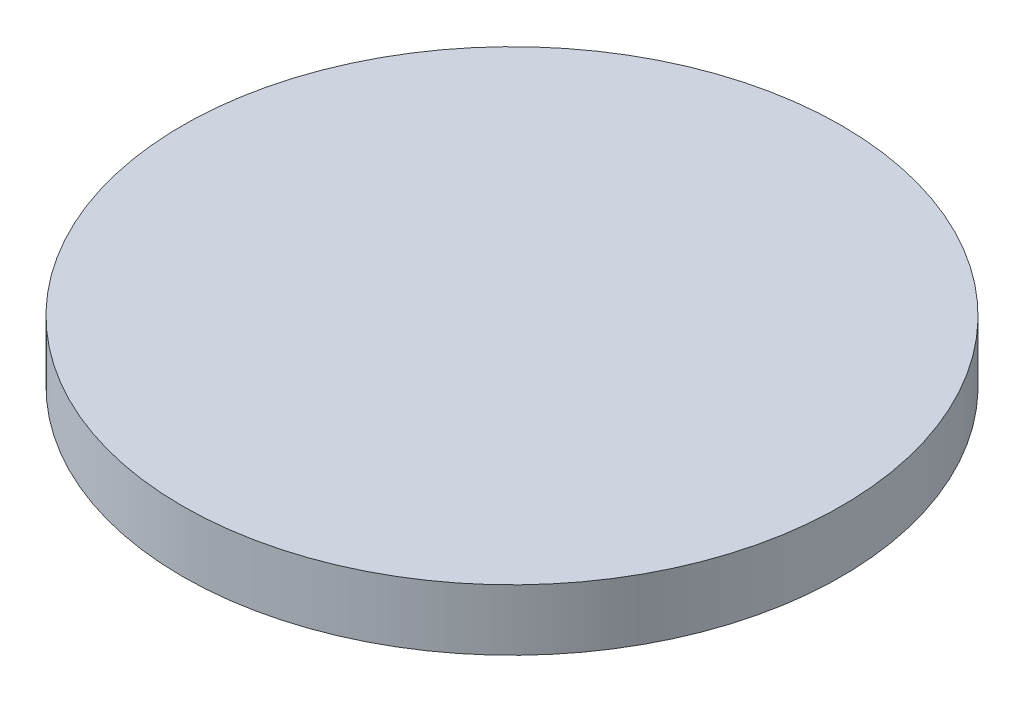
ISO-10303-21;
HEADER;
FILE_DESCRIPTION(('STEP AP214'),'2;1');
FILE_NAME('part.step','',(''),(''),'','','');
FILE_SCHEMA(('AUTOMOTIVE_DESIGN { 1 0 10303 214 1 1 1 1 }'));
ENDSEC;
DATA;
#1=APPLICATION_CONTEXT('core data for automotive mechanical design processes');
#2=APPLICATION_PROTOCOL_DEFINITION('international standard','automotive_design',2000,#1);
#3=PRODUCT_CONTEXT('',#1,'mechanical');
#4=PRODUCT('Part','Part','',(#3));
#5=PRODUCT_RELATED_PRODUCT_CATEGORY('part','',(#4));
#6=PRODUCT_DEFINITION_FORMATION('','',#4);
#7=PRODUCT_DEFINITION_CONTEXT('part definition',#1,'design');
#8=PRODUCT_DEFINITION('design','',#6,#7);
#9=PRODUCT_DEFINITION_SHAPE('','',#8);
#10=(LENGTH_UNIT() NAMED_UNIT(*) SI_UNIT(.MILLI.,.METRE.));
#11=(NAMED_UNIT(*) PLANE_ANGLE_UNIT() SI_UNIT($,.RADIAN.));
#12=(NAMED_UNIT(*) SI_UNIT($,.STERADIAN.) SOLID_ANGLE_UNIT());
#13=UNCERTAINTY_MEASURE_WITH_UNIT(LENGTH_MEASURE(1.E-05),#10,'distance_accuracy_value','');
#14=(GEOMETRIC_REPRESENTATION_CONTEXT(3) GLOBAL_UNCERTAINTY_ASSIGNED_CONTEXT((#13)) GLOBAL_UNIT_ASSIGNED_CONTEXT((#10,
#11,#12)) REPRESENTATION_CONTEXT('',''));
#15=CARTESIAN_POINT('',(0.,0.,0.));
#16=DIRECTION('',(0.,0.,1.));
#17=DIRECTION('',(1.,0.,0.));
#18=AXIS2_PLACEMENT_3D('',#15,#16,#17);
#19=CARTESIAN_POINT('',(0.,5.,0.));
#20=DIRECTION('',(0.,-1.,0.));
#21=DIRECTION('',(0.,0.,-1.));
#22=AXIS2_PLACEMENT_3D('',#19,#20,#21);
#23=CYLINDRICAL_SURFACE('',#22,27.);
#24=CARTESIAN_POINT('',(0.,5.,0.));
#25=DIRECTION('',(0.,1.,0.));
#26=DIRECTION('',(0.,0.,1.));
#27=AXIS2_PLACEMENT_3D('',#24,#25,#26);
#28=CIRCLE('',#27,27.);
#29=CARTESIAN_POINT('',(0.,5.,27.));
#30=VERTEX_POINT('',#29);
#31=EDGE_CURVE('E10',#30,#30,#28,.T.);
#32=ORIENTED_EDGE('',*,*,#31,.F.);
#33=EDGE_LOOP('',(#32));
#34=FACE_BOUND('',#33,.T.);
#35=CARTESIAN_POINT('',(0.,0.,0.));
#36=DIRECTION('',(0.,1.,0.));
#37=DIRECTION('',(0.,0.,1.));
#38=AXIS2_PLACEMENT_3D('',#35,#36,#37);
#39=CIRCLE('',#38,27.);
#40=CARTESIAN_POINT('',(0.,0.,27.));
#41=VERTEX_POINT('',#40);
#42=EDGE_CURVE('E44',#41,#41,#39,.T.);
#43=ORIENTED_EDGE('',*,*,#42,.T.);
#44=EDGE_LOOP('',(#43));
#45=FACE_BOUND('',#44,.T.);
#46=ADVANCED_FACE('F41',(#34,#45),#23,.T.);
#47=CARTESIAN_POINT('',(0.,5.,0.));
#48=DIRECTION('',(0.,1.,0.));
#49=DIRECTION('',(0.,0.,1.));
#50=AXIS2_PLACEMENT_3D('',#47,#48,#49);
#51=PLANE('',#50);
#52=ORIENTED_EDGE('',*,*,#31,.T.);
#53=EDGE_LOOP('',(#52));
#54=FACE_BOUND('',#53,.T.);
#55=ADVANCED_FACE('F58',(#54),#51,.T.);
#56=CARTESIAN_POINT('',(0.,0.,0.));
#57=DIRECTION('',(0.,1.,0.));
#58=DIRECTION('',(0.,0.,1.));
#59=AXIS2_PLACEMENT_3D('',#56,#57,#58);
#60=PLANE('',#59);
#61=ORIENTED_EDGE('',*,*,#42,.F.);
#62=EDGE_LOOP('',(#61));
#63=FACE_BOUND('',#62,.T.);
#64=ADVANCED_FACE('F56',(#63),#60,.F.);
#65=CLOSED_SHELL('',(#46,#55,#64));
#66=MANIFOLD_SOLID_BREP('B2',#65);
#67=ADVANCED_BREP_SHAPE_REPRESENTATION('',(#18,#66),#14);
#68=SHAPE_DEFINITION_REPRESENTATION(#9,#67);
ENDSEC;
END-ISO-10303-21;
